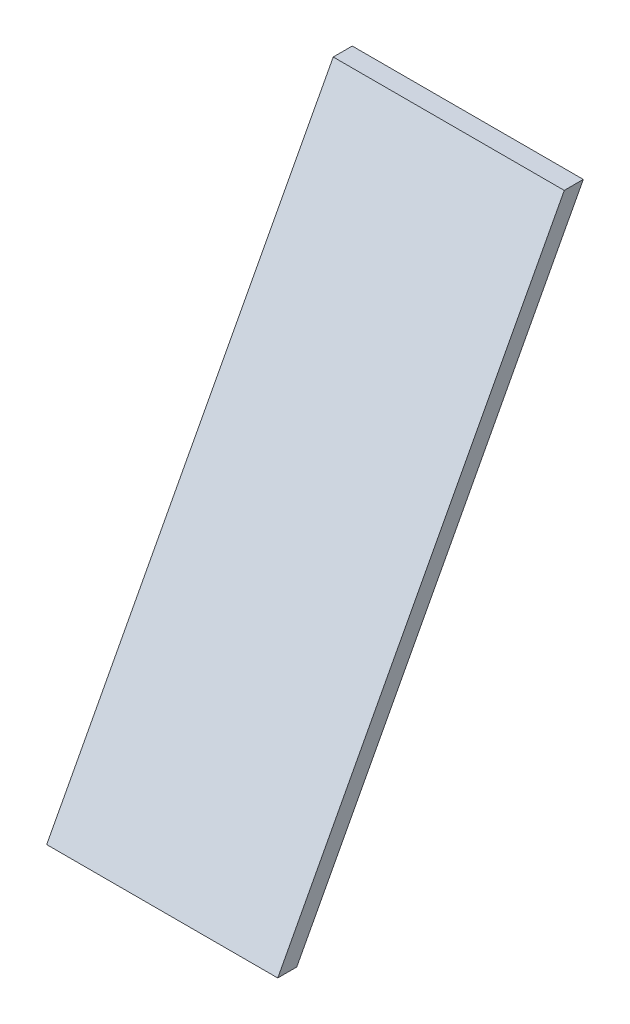
ISO-10303-21;
HEADER;
FILE_DESCRIPTION(('STEP AP214'),'2;1');
FILE_NAME('part.step','',(''),(''),'','','');
FILE_SCHEMA(('AUTOMOTIVE_DESIGN { 1 0 10303 214 1 1 1 1 }'));
ENDSEC;
DATA;
#1=APPLICATION_CONTEXT('core data for automotive mechanical design processes');
#2=APPLICATION_PROTOCOL_DEFINITION('international standard','automotive_design',2000,#1);
#3=PRODUCT_CONTEXT('',#1,'mechanical');
#4=PRODUCT('Part','Part','',(#3));
#5=PRODUCT_RELATED_PRODUCT_CATEGORY('part','',(#4));
#6=PRODUCT_DEFINITION_FORMATION('','',#4);
#7=PRODUCT_DEFINITION_CONTEXT('part definition',#1,'design');
#8=PRODUCT_DEFINITION('design','',#6,#7);
#9=PRODUCT_DEFINITION_SHAPE('','',#8);
#10=(LENGTH_UNIT() NAMED_UNIT(*) SI_UNIT(.MILLI.,.METRE.));
#11=(NAMED_UNIT(*) PLANE_ANGLE_UNIT() SI_UNIT($,.RADIAN.));
#12=(NAMED_UNIT(*) SI_UNIT($,.STERADIAN.) SOLID_ANGLE_UNIT());
#13=UNCERTAINTY_MEASURE_WITH_UNIT(LENGTH_MEASURE(1.E-05),#10,'distance_accuracy_value','');
#14=(GEOMETRIC_REPRESENTATION_CONTEXT(3) GLOBAL_UNCERTAINTY_ASSIGNED_CONTEXT((#13)) GLOBAL_UNIT_ASSIGNED_CONTEXT((#10,
#11,#12)) REPRESENTATION_CONTEXT('',''));
#15=CARTESIAN_POINT('',(0.,0.,0.));
#16=DIRECTION('',(0.,0.,1.));
#17=DIRECTION('',(1.,0.,0.));
#18=AXIS2_PLACEMENT_3D('',#15,#16,#17);
#19=CARTESIAN_POINT('',(43.65,-0.00999999999995449,-170.265974623788));
#20=DIRECTION('',(1.,0.,0.));
#21=DIRECTION('',(0.,0.,-1.));
#22=AXIS2_PLACEMENT_3D('',#19,#20,#21);
#23=PLANE('',#22);
#24=DIRECTION('',(0.,0.,1.));
#25=VECTOR('',#24,1.);
#26=CARTESIAN_POINT('',(43.65,203.6,-21.9542024237733));
#27=LINE('',#26,#25);
#28=CARTESIAN_POINT('',(43.65,203.6,-29.1460222456487));
#29=VERTEX_POINT('',#28);
#30=CARTESIAN_POINT('',(43.65,203.6,-21.9542024237733));
#31=VERTEX_POINT('',#30);
#32=EDGE_CURVE('E83',#29,#31,#27,.T.);
#33=ORIENTED_EDGE('',*,*,#32,.T.);
#34=DIRECTION('',(0.,-0.882947592858925,0.469471562785895));
#35=VECTOR('',#34,1.);
#36=CARTESIAN_POINT('',(43.65,0.,86.301837862505));
#37=LINE('',#36,#35);
#38=CARTESIAN_POINT('',(43.65,0.,86.301837862505));
#39=VERTEX_POINT('',#38);
#40=EDGE_CURVE('E40',#31,#39,#37,.T.);
#41=ORIENTED_EDGE('',*,*,#40,.T.);
#42=DIRECTION('',(0.,0.,1.));
#43=VECTOR('',#42,1.);
#44=CARTESIAN_POINT('',(43.65,0.,-143.164202423773));
#45=LINE('',#44,#43);
#46=CARTESIAN_POINT('',(43.65,0.,79.1100180406296));
#47=VERTEX_POINT('',#46);
#48=EDGE_CURVE('E85',#47,#39,#45,.T.);
#49=ORIENTED_EDGE('',*,*,#48,.F.);
#50=DIRECTION('',(0.,-0.882947592858925,0.469471562785895));
#51=VECTOR('',#50,1.);
#52=CARTESIAN_POINT('',(43.65,32.7925886605948,61.6738893611959));
#53=LINE('',#52,#51);
#54=EDGE_CURVE('E81',#29,#47,#53,.T.);
#55=ORIENTED_EDGE('',*,*,#54,.F.);
#56=EDGE_LOOP('',(#33,#41,#49,#55));
#57=FACE_BOUND('',#56,.T.);
#58=ADVANCED_FACE('F36',(#57),#23,.T.);
#59=CARTESIAN_POINT('',(-43.65,-0.00999999999995449,-170.265974623788));
#60=DIRECTION('',(-1.,0.,0.));
#61=DIRECTION('',(0.,0.,1.));
#62=AXIS2_PLACEMENT_3D('',#59,#60,#61);
#63=PLANE('',#62);
#64=DIRECTION('',(0.,0.,-1.));
#65=VECTOR('',#64,1.);
#66=CARTESIAN_POINT('',(-43.65,0.,-143.164202423773));
#67=LINE('',#66,#65);
#68=CARTESIAN_POINT('',(-43.65,0.,86.301837862505));
#69=VERTEX_POINT('',#68);
#70=CARTESIAN_POINT('',(-43.65,0.,79.1100180406296));
#71=VERTEX_POINT('',#70);
#72=EDGE_CURVE('E99',#69,#71,#67,.T.);
#73=ORIENTED_EDGE('',*,*,#72,.F.);
#74=DIRECTION('',(0.,0.882947592858925,-0.469471562785895));
#75=VECTOR('',#74,1.);
#76=CARTESIAN_POINT('',(-43.65,0.,86.301837862505));
#77=LINE('',#76,#75);
#78=CARTESIAN_POINT('',(-43.65,203.6,-21.9542024237733));
#79=VERTEX_POINT('',#78);
#80=EDGE_CURVE('E89',#69,#79,#77,.T.);
#81=ORIENTED_EDGE('',*,*,#80,.T.);
#82=DIRECTION('',(0.,0.,-1.));
#83=VECTOR('',#82,1.);
#84=CARTESIAN_POINT('',(-43.65,203.6,-21.9542024237733));
#85=LINE('',#84,#83);
#86=CARTESIAN_POINT('',(-43.65,203.6,-29.1460222456487));
#87=VERTEX_POINT('',#86);
#88=EDGE_CURVE('E90',#79,#87,#85,.T.);
#89=ORIENTED_EDGE('',*,*,#88,.T.);
#90=DIRECTION('',(0.,-0.882947592858925,0.469471562785895));
#91=VECTOR('',#90,1.);
#92=CARTESIAN_POINT('',(-43.65,32.7925886605948,61.6738893611959));
#93=LINE('',#92,#91);
#94=EDGE_CURVE('E11',#87,#71,#93,.T.);
#95=ORIENTED_EDGE('',*,*,#94,.T.);
#96=EDGE_LOOP('',(#73,#81,#89,#95));
#97=FACE_BOUND('',#96,.T.);
#98=ADVANCED_FACE('F38',(#97),#63,.T.);
#99=CARTESIAN_POINT('',(50.,0.,86.301837862505));
#100=DIRECTION('',(0.,-0.469471562785895,-0.882947592858925));
#101=DIRECTION('',(0.,0.882947592858925,-0.469471562785895));
#102=AXIS2_PLACEMENT_3D('',#99,#100,#101);
#103=PLANE('',#102);
#104=ORIENTED_EDGE('',*,*,#80,.F.);
#105=DIRECTION('',(-1.,0.,0.));
#106=VECTOR('',#105,1.);
#107=CARTESIAN_POINT('',(50.,0.,86.301837862505));
#108=LINE('',#107,#106);
#109=EDGE_CURVE('E94',#39,#69,#108,.T.);
#110=ORIENTED_EDGE('',*,*,#109,.F.);
#111=ORIENTED_EDGE('',*,*,#40,.F.);
#112=DIRECTION('',(-1.,0.,0.));
#113=VECTOR('',#112,1.);
#114=CARTESIAN_POINT('',(50.,203.6,-21.9542024237733));
#115=LINE('',#114,#113);
#116=EDGE_CURVE('E88',#31,#79,#115,.T.);
#117=ORIENTED_EDGE('',*,*,#116,.T.);
#118=EDGE_LOOP('',(#104,#110,#111,#117));
#119=FACE_BOUND('',#118,.T.);
#120=ADVANCED_FACE('F109',(#119),#103,.F.);
#121=CARTESIAN_POINT('',(-62.575,0.,-143.164202423773));
#122=DIRECTION('',(0.,-1.,0.));
#123=DIRECTION('',(1.,0.,0.));
#124=AXIS2_PLACEMENT_3D('',#121,#122,#123);
#125=PLANE('',#124);
#126=ORIENTED_EDGE('',*,*,#109,.T.);
#127=ORIENTED_EDGE('',*,*,#72,.T.);
#128=DIRECTION('',(-1.,0.,0.));
#129=VECTOR('',#128,1.);
#130=CARTESIAN_POINT('',(50.,0.,79.1100180406296));
#131=LINE('',#130,#129);
#132=EDGE_CURVE('E60',#47,#71,#131,.T.);
#133=ORIENTED_EDGE('',*,*,#132,.F.);
#134=ORIENTED_EDGE('',*,*,#48,.T.);
#135=EDGE_LOOP('',(#126,#127,#133,#134));
#136=FACE_BOUND('',#135,.T.);
#137=ADVANCED_FACE('F106',(#136),#125,.T.);
#138=CARTESIAN_POINT('',(50.,203.6,-21.9542024237733));
#139=DIRECTION('',(0.,-1.,0.));
#140=DIRECTION('',(0.,0.,-1.));
#141=AXIS2_PLACEMENT_3D('',#138,#139,#140);
#142=PLANE('',#141);
#143=ORIENTED_EDGE('',*,*,#88,.F.);
#144=ORIENTED_EDGE('',*,*,#116,.F.);
#145=ORIENTED_EDGE('',*,*,#32,.F.);
#146=DIRECTION('',(-1.,0.,0.));
#147=VECTOR('',#146,1.);
#148=CARTESIAN_POINT('',(50.,203.6,-29.1460222456487));
#149=LINE('',#148,#147);
#150=EDGE_CURVE('E52',#29,#87,#149,.T.);
#151=ORIENTED_EDGE('',*,*,#150,.T.);
#152=EDGE_LOOP('',(#143,#144,#145,#151));
#153=FACE_BOUND('',#152,.T.);
#154=ADVANCED_FACE('F87',(#153),#142,.F.);
#155=CARTESIAN_POINT('',(50.,-2.98114442369041,80.6951206478509));
#156=DIRECTION('',(0.,-0.469471562785895,-0.882947592858925));
#157=DIRECTION('',(0.,0.882947592858925,-0.469471562785895));
#158=AXIS2_PLACEMENT_3D('',#155,#156,#157);
#159=PLANE('',#158);
#160=ORIENTED_EDGE('',*,*,#94,.F.);
#161=ORIENTED_EDGE('',*,*,#150,.F.);
#162=ORIENTED_EDGE('',*,*,#54,.T.);
#163=ORIENTED_EDGE('',*,*,#132,.T.);
#164=EDGE_LOOP('',(#160,#161,#162,#163));
#165=FACE_BOUND('',#164,.T.);
#166=ADVANCED_FACE('F92',(#165),#159,.T.);
#167=CLOSED_SHELL('',(#58,#98,#120,#137,#154,#166));
#168=MANIFOLD_SOLID_BREP('B2',#167);
#169=ADVANCED_BREP_SHAPE_REPRESENTATION('',(#18,#168),#14);
#170=SHAPE_DEFINITION_REPRESENTATION(#9,#169);
ENDSEC;
END-ISO-10303-21;
